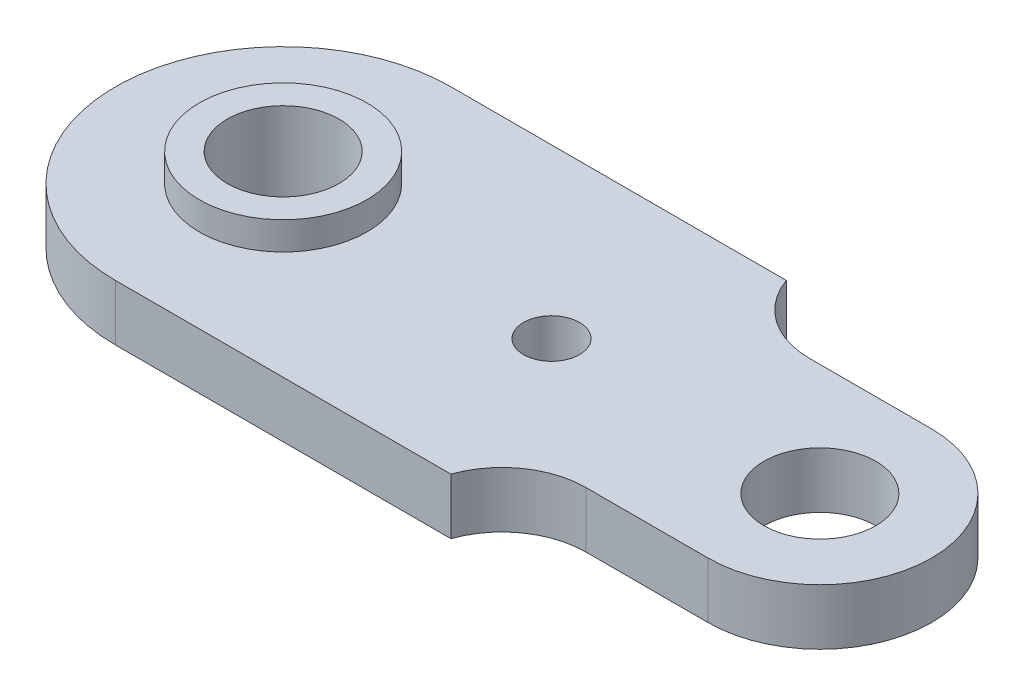
ISO-10303-21;
HEADER;
FILE_DESCRIPTION(('STEP AP214'),'2;1');
FILE_NAME('part.step','',(''),(''),'','','');
FILE_SCHEMA(('AUTOMOTIVE_DESIGN { 1 0 10303 214 1 1 1 1 }'));
ENDSEC;
DATA;
#1=APPLICATION_CONTEXT('core data for automotive mechanical design processes');
#2=APPLICATION_PROTOCOL_DEFINITION('international standard','automotive_design',2000,#1);
#3=PRODUCT_CONTEXT('',#1,'mechanical');
#4=PRODUCT('Part','Part','',(#3));
#5=PRODUCT_RELATED_PRODUCT_CATEGORY('part','',(#4));
#6=PRODUCT_DEFINITION_FORMATION('','',#4);
#7=PRODUCT_DEFINITION_CONTEXT('part definition',#1,'design');
#8=PRODUCT_DEFINITION('design','',#6,#7);
#9=PRODUCT_DEFINITION_SHAPE('','',#8);
#10=(LENGTH_UNIT() NAMED_UNIT(*) SI_UNIT(.MILLI.,.METRE.));
#11=(NAMED_UNIT(*) PLANE_ANGLE_UNIT() SI_UNIT($,.RADIAN.));
#12=(NAMED_UNIT(*) SI_UNIT($,.STERADIAN.) SOLID_ANGLE_UNIT());
#13=UNCERTAINTY_MEASURE_WITH_UNIT(LENGTH_MEASURE(1.E-05),#10,'distance_accuracy_value','');
#14=(GEOMETRIC_REPRESENTATION_CONTEXT(3) GLOBAL_UNCERTAINTY_ASSIGNED_CONTEXT((#13)) GLOBAL_UNIT_ASSIGNED_CONTEXT((#10,
#11,#12)) REPRESENTATION_CONTEXT('',''));
#15=CARTESIAN_POINT('',(0.,0.,0.));
#16=DIRECTION('',(0.,0.,1.));
#17=DIRECTION('',(1.,0.,0.));
#18=AXIS2_PLACEMENT_3D('',#15,#16,#17);
#19=CARTESIAN_POINT('',(0.,10.,0.));
#20=DIRECTION('',(0.,1.,0.));
#21=DIRECTION('',(0.,0.,1.));
#22=AXIS2_PLACEMENT_3D('',#19,#20,#21);
#23=PLANE('',#22);
#24=CARTESIAN_POINT('',(48.,10.,0.));
#25=DIRECTION('',(0.,1.,0.));
#26=DIRECTION('',(0.,0.,1.));
#27=AXIS2_PLACEMENT_3D('',#24,#25,#26);
#28=CIRCLE('',#27,10.);
#29=CARTESIAN_POINT('',(48.,10.,10.));
#30=VERTEX_POINT('',#29);
#31=EDGE_CURVE('E128',#30,#30,#28,.T.);
#32=ORIENTED_EDGE('',*,*,#31,.F.);
#33=EDGE_LOOP('',(#32));
#34=FACE_BOUND('',#33,.T.);
#35=CARTESIAN_POINT('',(-48.,10.,0.));
#36=DIRECTION('',(0.,1.,0.));
#37=DIRECTION('',(0.,0.,1.));
#38=AXIS2_PLACEMENT_3D('',#35,#36,#37);
#39=CIRCLE('',#38,30.);
#40=CARTESIAN_POINT('',(-48.,10.,-30.));
#41=VERTEX_POINT('',#40);
#42=CARTESIAN_POINT('',(-48.,10.,30.));
#43=VERTEX_POINT('',#42);
#44=EDGE_CURVE('E189',#41,#43,#39,.T.);
#45=ORIENTED_EDGE('',*,*,#44,.T.);
#46=DIRECTION('',(1.,0.,0.));
#47=VECTOR('',#46,1.);
#48=CARTESIAN_POINT('',(0.,10.,30.));
#49=LINE('',#48,#47);
#50=CARTESIAN_POINT('',(12.,10.,30.));
#51=VERTEX_POINT('',#50);
#52=EDGE_CURVE('E87',#43,#51,#49,.T.);
#53=ORIENTED_EDGE('',*,*,#52,.T.);
#54=CARTESIAN_POINT('',(26.1421356237309,10.,35.));
#55=DIRECTION('',(0.,1.,0.));
#56=DIRECTION('',(0.,0.,1.));
#57=AXIS2_PLACEMENT_3D('',#54,#55,#56);
#58=CIRCLE('',#57,15.);
#59=CARTESIAN_POINT('',(26.1421356237309,10.,20.));
#60=VERTEX_POINT('',#59);
#61=EDGE_CURVE('E175',#51,#60,#58,.F.);
#62=ORIENTED_EDGE('',*,*,#61,.T.);
#63=DIRECTION('',(-1.,0.,0.));
#64=VECTOR('',#63,1.);
#65=CARTESIAN_POINT('',(0.,10.,20.));
#66=LINE('',#65,#64);
#67=CARTESIAN_POINT('',(48.,10.,20.));
#68=VERTEX_POINT('',#67);
#69=EDGE_CURVE('E184',#68,#60,#66,.T.);
#70=ORIENTED_EDGE('',*,*,#69,.F.);
#71=CARTESIAN_POINT('',(48.,10.,0.));
#72=DIRECTION('',(0.,1.,0.));
#73=DIRECTION('',(0.,0.,1.));
#74=AXIS2_PLACEMENT_3D('',#71,#72,#73);
#75=CIRCLE('',#74,20.);
#76=CARTESIAN_POINT('',(48.,10.,-20.));
#77=VERTEX_POINT('',#76);
#78=EDGE_CURVE('E111',#68,#77,#75,.T.);
#79=ORIENTED_EDGE('',*,*,#78,.T.);
#80=DIRECTION('',(-1.,0.,0.));
#81=VECTOR('',#80,1.);
#82=CARTESIAN_POINT('',(0.,10.,-20.));
#83=LINE('',#82,#81);
#84=CARTESIAN_POINT('',(26.1421356237309,10.,-20.));
#85=VERTEX_POINT('',#84);
#86=EDGE_CURVE('E103',#77,#85,#83,.T.);
#87=ORIENTED_EDGE('',*,*,#86,.T.);
#88=CARTESIAN_POINT('',(26.1421356237309,10.,-35.));
#89=DIRECTION('',(0.,1.,0.));
#90=DIRECTION('',(0.,0.,1.));
#91=AXIS2_PLACEMENT_3D('',#88,#89,#90);
#92=CIRCLE('',#91,15.);
#93=CARTESIAN_POINT('',(12.,10.,-30.));
#94=VERTEX_POINT('',#93);
#95=EDGE_CURVE('E108',#94,#85,#92,.T.);
#96=ORIENTED_EDGE('',*,*,#95,.F.);
#97=DIRECTION('',(1.,0.,0.));
#98=VECTOR('',#97,1.);
#99=CARTESIAN_POINT('',(0.,10.,-30.));
#100=LINE('',#99,#98);
#101=EDGE_CURVE('E126',#41,#94,#100,.T.);
#102=ORIENTED_EDGE('',*,*,#101,.F.);
#103=EDGE_LOOP('',(#45,#53,#62,#70,#79,#87,#96,#102));
#104=FACE_BOUND('',#103,.T.);
#105=CARTESIAN_POINT('',(0.,10.,0.));
#106=DIRECTION('',(0.,1.,0.));
#107=DIRECTION('',(0.,0.,1.));
#108=AXIS2_PLACEMENT_3D('',#105,#106,#107);
#109=CIRCLE('',#108,5.);
#110=CARTESIAN_POINT('',(0.,10.,5.));
#111=VERTEX_POINT('',#110);
#112=EDGE_CURVE('E162',#111,#111,#109,.T.);
#113=ORIENTED_EDGE('',*,*,#112,.F.);
#114=EDGE_LOOP('',(#113));
#115=FACE_BOUND('',#114,.T.);
#116=CARTESIAN_POINT('',(-48.,10.,0.));
#117=DIRECTION('',(0.,1.,0.));
#118=DIRECTION('',(0.,0.,1.));
#119=AXIS2_PLACEMENT_3D('',#116,#117,#118);
#120=CIRCLE('',#119,15.);
#121=CARTESIAN_POINT('',(-48.,10.,15.));
#122=VERTEX_POINT('',#121);
#123=EDGE_CURVE('E193',#122,#122,#120,.T.);
#124=ORIENTED_EDGE('',*,*,#123,.F.);
#125=EDGE_LOOP('',(#124));
#126=FACE_BOUND('',#125,.T.);
#127=ADVANCED_FACE('F32',(#34,#104,#115,#126),#23,.T.);
#128=CARTESIAN_POINT('',(-48.,10.,0.));
#129=DIRECTION('',(0.,-1.,0.));
#130=DIRECTION('',(0.,0.,-1.));
#131=AXIS2_PLACEMENT_3D('',#128,#129,#130);
#132=CYLINDRICAL_SURFACE('',#131,30.);
#133=CARTESIAN_POINT('',(-48.,0.,0.));
#134=DIRECTION('',(0.,1.,0.));
#135=DIRECTION('',(0.,0.,1.));
#136=AXIS2_PLACEMENT_3D('',#133,#134,#135);
#137=CIRCLE('',#136,30.);
#138=CARTESIAN_POINT('',(-48.,0.,-30.));
#139=VERTEX_POINT('',#138);
#140=CARTESIAN_POINT('',(-48.,0.,30.));
#141=VERTEX_POINT('',#140);
#142=EDGE_CURVE('E141',#139,#141,#137,.T.);
#143=ORIENTED_EDGE('',*,*,#142,.T.);
#144=DIRECTION('',(0.,-1.,0.));
#145=VECTOR('',#144,1.);
#146=CARTESIAN_POINT('',(-48.,10.,30.));
#147=LINE('',#146,#145);
#148=EDGE_CURVE('E11',#43,#141,#147,.T.);
#149=ORIENTED_EDGE('',*,*,#148,.F.);
#150=ORIENTED_EDGE('',*,*,#44,.F.);
#151=DIRECTION('',(0.,-1.,0.));
#152=VECTOR('',#151,1.);
#153=CARTESIAN_POINT('',(-48.,10.,-30.));
#154=LINE('',#153,#152);
#155=EDGE_CURVE('E49',#41,#139,#154,.T.);
#156=ORIENTED_EDGE('',*,*,#155,.T.);
#157=EDGE_LOOP('',(#143,#149,#150,#156));
#158=FACE_BOUND('',#157,.T.);
#159=ADVANCED_FACE('F219',(#158),#132,.T.);
#160=CARTESIAN_POINT('',(0.,10.,30.));
#161=DIRECTION('',(0.,0.,-1.));
#162=DIRECTION('',(-1.,0.,0.));
#163=AXIS2_PLACEMENT_3D('',#160,#161,#162);
#164=PLANE('',#163);
#165=DIRECTION('',(1.,0.,0.));
#166=VECTOR('',#165,1.);
#167=CARTESIAN_POINT('',(0.,0.,30.));
#168=LINE('',#167,#166);
#169=CARTESIAN_POINT('',(12.,0.,30.));
#170=VERTEX_POINT('',#169);
#171=EDGE_CURVE('E143',#141,#170,#168,.T.);
#172=ORIENTED_EDGE('',*,*,#171,.T.);
#173=DIRECTION('',(0.,-1.,0.));
#174=VECTOR('',#173,1.);
#175=CARTESIAN_POINT('',(12.,10.,30.));
#176=LINE('',#175,#174);
#177=EDGE_CURVE('E41',#51,#170,#176,.T.);
#178=ORIENTED_EDGE('',*,*,#177,.F.);
#179=ORIENTED_EDGE('',*,*,#52,.F.);
#180=ORIENTED_EDGE('',*,*,#148,.T.);
#181=EDGE_LOOP('',(#172,#178,#179,#180));
#182=FACE_BOUND('',#181,.T.);
#183=ADVANCED_FACE('F225',(#182),#164,.F.);
#184=CARTESIAN_POINT('',(26.1421356237309,10.,35.));
#185=DIRECTION('',(0.,-1.,0.));
#186=DIRECTION('',(0.,0.,-1.));
#187=AXIS2_PLACEMENT_3D('',#184,#185,#186);
#188=CYLINDRICAL_SURFACE('',#187,15.);
#189=CARTESIAN_POINT('',(26.1421356237309,0.,35.));
#190=DIRECTION('',(0.,1.,0.));
#191=DIRECTION('',(0.,0.,1.));
#192=AXIS2_PLACEMENT_3D('',#189,#190,#191);
#193=CIRCLE('',#192,15.);
#194=CARTESIAN_POINT('',(26.1421356237309,0.,20.));
#195=VERTEX_POINT('',#194);
#196=EDGE_CURVE('E145',#170,#195,#193,.F.);
#197=ORIENTED_EDGE('',*,*,#196,.T.);
#198=DIRECTION('',(0.,-1.,0.));
#199=VECTOR('',#198,1.);
#200=CARTESIAN_POINT('',(26.1421356237309,10.,20.));
#201=LINE('',#200,#199);
#202=EDGE_CURVE('E168',#60,#195,#201,.T.);
#203=ORIENTED_EDGE('',*,*,#202,.F.);
#204=ORIENTED_EDGE('',*,*,#61,.F.);
#205=ORIENTED_EDGE('',*,*,#177,.T.);
#206=EDGE_LOOP('',(#197,#203,#204,#205));
#207=FACE_BOUND('',#206,.T.);
#208=ADVANCED_FACE('F173',(#207),#188,.F.);
#209=CARTESIAN_POINT('',(0.,10.,20.));
#210=DIRECTION('',(0.,0.,1.));
#211=DIRECTION('',(1.,0.,0.));
#212=AXIS2_PLACEMENT_3D('',#209,#210,#211);
#213=PLANE('',#212);
#214=DIRECTION('',(-1.,0.,0.));
#215=VECTOR('',#214,1.);
#216=CARTESIAN_POINT('',(0.,0.,20.));
#217=LINE('',#216,#215);
#218=CARTESIAN_POINT('',(48.,0.,20.));
#219=VERTEX_POINT('',#218);
#220=EDGE_CURVE('E148',#219,#195,#217,.T.);
#221=ORIENTED_EDGE('',*,*,#220,.F.);
#222=DIRECTION('',(0.,-1.,0.));
#223=VECTOR('',#222,1.);
#224=CARTESIAN_POINT('',(48.,10.,20.));
#225=LINE('',#224,#223);
#226=EDGE_CURVE('E166',#68,#219,#225,.T.);
#227=ORIENTED_EDGE('',*,*,#226,.F.);
#228=ORIENTED_EDGE('',*,*,#69,.T.);
#229=ORIENTED_EDGE('',*,*,#202,.T.);
#230=EDGE_LOOP('',(#221,#227,#228,#229));
#231=FACE_BOUND('',#230,.T.);
#232=ADVANCED_FACE('F182',(#231),#213,.T.);
#233=CARTESIAN_POINT('',(48.,10.,0.));
#234=DIRECTION('',(0.,-1.,0.));
#235=DIRECTION('',(0.,0.,-1.));
#236=AXIS2_PLACEMENT_3D('',#233,#234,#235);
#237=CYLINDRICAL_SURFACE('',#236,20.);
#238=CARTESIAN_POINT('',(48.,0.,0.));
#239=DIRECTION('',(0.,1.,0.));
#240=DIRECTION('',(0.,0.,1.));
#241=AXIS2_PLACEMENT_3D('',#238,#239,#240);
#242=CIRCLE('',#241,20.);
#243=CARTESIAN_POINT('',(48.,0.,-20.));
#244=VERTEX_POINT('',#243);
#245=EDGE_CURVE('E151',#219,#244,#242,.T.);
#246=ORIENTED_EDGE('',*,*,#245,.T.);
#247=DIRECTION('',(0.,-1.,0.));
#248=VECTOR('',#247,1.);
#249=CARTESIAN_POINT('',(48.,10.,-20.));
#250=LINE('',#249,#248);
#251=EDGE_CURVE('E123',#77,#244,#250,.T.);
#252=ORIENTED_EDGE('',*,*,#251,.F.);
#253=ORIENTED_EDGE('',*,*,#78,.F.);
#254=ORIENTED_EDGE('',*,*,#226,.T.);
#255=EDGE_LOOP('',(#246,#252,#253,#254));
#256=FACE_BOUND('',#255,.T.);
#257=ADVANCED_FACE('F239',(#256),#237,.T.);
#258=CARTESIAN_POINT('',(0.,10.,-20.));
#259=DIRECTION('',(0.,0.,1.));
#260=DIRECTION('',(1.,0.,0.));
#261=AXIS2_PLACEMENT_3D('',#258,#259,#260);
#262=PLANE('',#261);
#263=DIRECTION('',(-1.,0.,0.));
#264=VECTOR('',#263,1.);
#265=CARTESIAN_POINT('',(0.,0.,-20.));
#266=LINE('',#265,#264);
#267=CARTESIAN_POINT('',(26.1421356237309,0.,-20.));
#268=VERTEX_POINT('',#267);
#269=EDGE_CURVE('E120',#244,#268,#266,.T.);
#270=ORIENTED_EDGE('',*,*,#269,.T.);
#271=DIRECTION('',(0.,-1.,0.));
#272=VECTOR('',#271,1.);
#273=CARTESIAN_POINT('',(26.1421356237309,10.,-20.));
#274=LINE('',#273,#272);
#275=EDGE_CURVE('E117',#85,#268,#274,.T.);
#276=ORIENTED_EDGE('',*,*,#275,.F.);
#277=ORIENTED_EDGE('',*,*,#86,.F.);
#278=ORIENTED_EDGE('',*,*,#251,.T.);
#279=EDGE_LOOP('',(#270,#276,#277,#278));
#280=FACE_BOUND('',#279,.T.);
#281=ADVANCED_FACE('F118',(#280),#262,.F.);
#282=CARTESIAN_POINT('',(26.1421356237309,10.,-35.));
#283=DIRECTION('',(0.,-1.,0.));
#284=DIRECTION('',(0.,0.,-1.));
#285=AXIS2_PLACEMENT_3D('',#282,#283,#284);
#286=CYLINDRICAL_SURFACE('',#285,15.);
#287=CARTESIAN_POINT('',(26.1421356237309,0.,-35.));
#288=DIRECTION('',(0.,1.,0.));
#289=DIRECTION('',(0.,0.,1.));
#290=AXIS2_PLACEMENT_3D('',#287,#288,#289);
#291=CIRCLE('',#290,15.);
#292=CARTESIAN_POINT('',(12.,0.,-30.));
#293=VERTEX_POINT('',#292);
#294=EDGE_CURVE('E154',#293,#268,#291,.T.);
#295=ORIENTED_EDGE('',*,*,#294,.F.);
#296=DIRECTION('',(0.,-1.,0.));
#297=VECTOR('',#296,1.);
#298=CARTESIAN_POINT('',(12.,10.,-30.));
#299=LINE('',#298,#297);
#300=EDGE_CURVE('E75',#94,#293,#299,.T.);
#301=ORIENTED_EDGE('',*,*,#300,.F.);
#302=ORIENTED_EDGE('',*,*,#95,.T.);
#303=ORIENTED_EDGE('',*,*,#275,.T.);
#304=EDGE_LOOP('',(#295,#301,#302,#303));
#305=FACE_BOUND('',#304,.T.);
#306=ADVANCED_FACE('F125',(#305),#286,.F.);
#307=CARTESIAN_POINT('',(0.,10.,-30.));
#308=DIRECTION('',(0.,0.,-1.));
#309=DIRECTION('',(-1.,0.,0.));
#310=AXIS2_PLACEMENT_3D('',#307,#308,#309);
#311=PLANE('',#310);
#312=DIRECTION('',(1.,0.,0.));
#313=VECTOR('',#312,1.);
#314=CARTESIAN_POINT('',(0.,0.,-30.));
#315=LINE('',#314,#313);
#316=EDGE_CURVE('E156',#139,#293,#315,.T.);
#317=ORIENTED_EDGE('',*,*,#316,.F.);
#318=ORIENTED_EDGE('',*,*,#155,.F.);
#319=ORIENTED_EDGE('',*,*,#101,.T.);
#320=ORIENTED_EDGE('',*,*,#300,.T.);
#321=EDGE_LOOP('',(#317,#318,#319,#320));
#322=FACE_BOUND('',#321,.T.);
#323=ADVANCED_FACE('F232',(#322),#311,.T.);
#324=CARTESIAN_POINT('',(-48.,10.,0.));
#325=DIRECTION('',(0.,-1.,0.));
#326=DIRECTION('',(0.,0.,-1.));
#327=AXIS2_PLACEMENT_3D('',#324,#325,#326);
#328=CYLINDRICAL_SURFACE('',#327,10.);
#329=CARTESIAN_POINT('',(-48.,0.,0.));
#330=DIRECTION('',(0.,1.,0.));
#331=DIRECTION('',(0.,0.,1.));
#332=AXIS2_PLACEMENT_3D('',#329,#330,#331);
#333=CIRCLE('',#332,10.);
#334=CARTESIAN_POINT('',(-48.,0.,10.));
#335=VERTEX_POINT('',#334);
#336=EDGE_CURVE('E137',#335,#335,#333,.T.);
#337=ORIENTED_EDGE('',*,*,#336,.F.);
#338=EDGE_LOOP('',(#337));
#339=FACE_BOUND('',#338,.T.);
#340=CARTESIAN_POINT('',(-48.,15.,0.));
#341=DIRECTION('',(0.,1.,0.));
#342=DIRECTION('',(0.,0.,1.));
#343=AXIS2_PLACEMENT_3D('',#340,#341,#342);
#344=CIRCLE('',#343,10.);
#345=CARTESIAN_POINT('',(-48.,15.,10.));
#346=VERTEX_POINT('',#345);
#347=EDGE_CURVE('E196',#346,#346,#344,.T.);
#348=ORIENTED_EDGE('',*,*,#347,.T.);
#349=EDGE_LOOP('',(#348));
#350=FACE_BOUND('',#349,.T.);
#351=ADVANCED_FACE('F202',(#339,#350),#328,.F.);
#352=CARTESIAN_POINT('',(0.,10.,0.));
#353=DIRECTION('',(0.,-1.,0.));
#354=DIRECTION('',(0.,0.,-1.));
#355=AXIS2_PLACEMENT_3D('',#352,#353,#354);
#356=CYLINDRICAL_SURFACE('',#355,5.);
#357=ORIENTED_EDGE('',*,*,#112,.T.);
#358=EDGE_LOOP('',(#357));
#359=FACE_BOUND('',#358,.T.);
#360=CARTESIAN_POINT('',(0.,0.,0.));
#361=DIRECTION('',(0.,1.,0.));
#362=DIRECTION('',(0.,0.,1.));
#363=AXIS2_PLACEMENT_3D('',#360,#361,#362);
#364=CIRCLE('',#363,5.);
#365=CARTESIAN_POINT('',(0.,0.,5.));
#366=VERTEX_POINT('',#365);
#367=EDGE_CURVE('E134',#366,#366,#364,.T.);
#368=ORIENTED_EDGE('',*,*,#367,.F.);
#369=EDGE_LOOP('',(#368));
#370=FACE_BOUND('',#369,.T.);
#371=ADVANCED_FACE('F34',(#359,#370),#356,.F.);
#372=CARTESIAN_POINT('',(48.,10.,0.));
#373=DIRECTION('',(0.,-1.,0.));
#374=DIRECTION('',(0.,0.,-1.));
#375=AXIS2_PLACEMENT_3D('',#372,#373,#374);
#376=CYLINDRICAL_SURFACE('',#375,10.);
#377=ORIENTED_EDGE('',*,*,#31,.T.);
#378=EDGE_LOOP('',(#377));
#379=FACE_BOUND('',#378,.T.);
#380=CARTESIAN_POINT('',(48.,0.,0.));
#381=DIRECTION('',(0.,1.,0.));
#382=DIRECTION('',(0.,0.,1.));
#383=AXIS2_PLACEMENT_3D('',#380,#381,#382);
#384=CIRCLE('',#383,10.);
#385=CARTESIAN_POINT('',(48.,0.,10.));
#386=VERTEX_POINT('',#385);
#387=EDGE_CURVE('E159',#386,#386,#384,.T.);
#388=ORIENTED_EDGE('',*,*,#387,.F.);
#389=EDGE_LOOP('',(#388));
#390=FACE_BOUND('',#389,.T.);
#391=ADVANCED_FACE('F215',(#379,#390),#376,.F.);
#392=CARTESIAN_POINT('',(0.,0.,0.));
#393=DIRECTION('',(0.,1.,0.));
#394=DIRECTION('',(0.,0.,1.));
#395=AXIS2_PLACEMENT_3D('',#392,#393,#394);
#396=PLANE('',#395);
#397=ORIENTED_EDGE('',*,*,#367,.T.);
#398=EDGE_LOOP('',(#397));
#399=FACE_BOUND('',#398,.T.);
#400=ORIENTED_EDGE('',*,*,#336,.T.);
#401=EDGE_LOOP('',(#400));
#402=FACE_BOUND('',#401,.T.);
#403=ORIENTED_EDGE('',*,*,#142,.F.);
#404=ORIENTED_EDGE('',*,*,#316,.T.);
#405=ORIENTED_EDGE('',*,*,#294,.T.);
#406=ORIENTED_EDGE('',*,*,#269,.F.);
#407=ORIENTED_EDGE('',*,*,#245,.F.);
#408=ORIENTED_EDGE('',*,*,#220,.T.);
#409=ORIENTED_EDGE('',*,*,#196,.F.);
#410=ORIENTED_EDGE('',*,*,#171,.F.);
#411=EDGE_LOOP('',(#403,#404,#405,#406,#407,#408,#409,#410));
#412=FACE_BOUND('',#411,.T.);
#413=ORIENTED_EDGE('',*,*,#387,.T.);
#414=EDGE_LOOP('',(#413));
#415=FACE_BOUND('',#414,.T.);
#416=ADVANCED_FACE('F177',(#399,#402,#412,#415),#396,.F.);
#417=CARTESIAN_POINT('',(-48.,15.,0.));
#418=DIRECTION('',(0.,1.,0.));
#419=DIRECTION('',(0.,0.,1.));
#420=AXIS2_PLACEMENT_3D('',#417,#418,#419);
#421=PLANE('',#420);
#422=CARTESIAN_POINT('',(-48.,15.,0.));
#423=DIRECTION('',(0.,1.,0.));
#424=DIRECTION('',(0.,0.,1.));
#425=AXIS2_PLACEMENT_3D('',#422,#423,#424);
#426=CIRCLE('',#425,15.);
#427=CARTESIAN_POINT('',(-48.,15.,15.));
#428=VERTEX_POINT('',#427);
#429=EDGE_CURVE('E138',#428,#428,#426,.T.);
#430=ORIENTED_EDGE('',*,*,#429,.T.);
#431=EDGE_LOOP('',(#430));
#432=FACE_BOUND('',#431,.T.);
#433=ORIENTED_EDGE('',*,*,#347,.F.);
#434=EDGE_LOOP('',(#433));
#435=FACE_BOUND('',#434,.T.);
#436=ADVANCED_FACE('F204',(#432,#435),#421,.T.);
#437=CARTESIAN_POINT('',(-48.,15.,0.));
#438=DIRECTION('',(0.,-1.,0.));
#439=DIRECTION('',(0.,0.,-1.));
#440=AXIS2_PLACEMENT_3D('',#437,#438,#439);
#441=CYLINDRICAL_SURFACE('',#440,15.);
#442=ORIENTED_EDGE('',*,*,#429,.F.);
#443=EDGE_LOOP('',(#442));
#444=FACE_BOUND('',#443,.T.);
#445=ORIENTED_EDGE('',*,*,#123,.T.);
#446=EDGE_LOOP('',(#445));
#447=FACE_BOUND('',#446,.T.);
#448=ADVANCED_FACE('F206',(#444,#447),#441,.T.);
#449=CLOSED_SHELL('',(#127,#159,#183,#208,#232,#257,#281,#306,#323,#351,#371,#391,#416,#436,#448));
#450=MANIFOLD_SOLID_BREP('B2',#449);
#451=ADVANCED_BREP_SHAPE_REPRESENTATION('',(#18,#450),#14);
#452=SHAPE_DEFINITION_REPRESENTATION(#9,#451);
ENDSEC;
END-ISO-10303-21;
